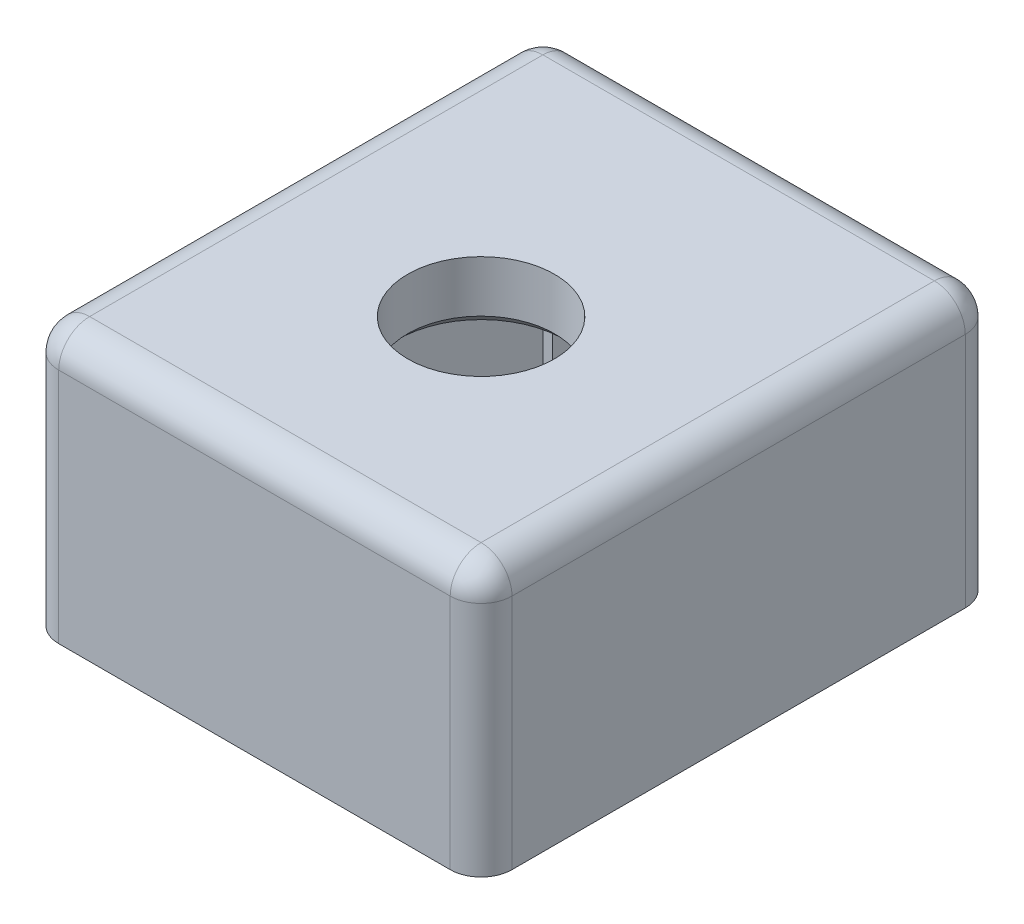
ISO-10303-21;
HEADER;
FILE_DESCRIPTION(('STEP AP214'),'2;1');
FILE_NAME('part.step','',(''),(''),'','','');
FILE_SCHEMA(('AUTOMOTIVE_DESIGN { 1 0 10303 214 1 1 1 1 }'));
ENDSEC;
DATA;
#1=APPLICATION_CONTEXT('core data for automotive mechanical design processes');
#2=APPLICATION_PROTOCOL_DEFINITION('international standard','automotive_design',2000,#1);
#3=PRODUCT_CONTEXT('',#1,'mechanical');
#4=PRODUCT('Part','Part','',(#3));
#5=PRODUCT_RELATED_PRODUCT_CATEGORY('part','',(#4));
#6=PRODUCT_DEFINITION_FORMATION('','',#4);
#7=PRODUCT_DEFINITION_CONTEXT('part definition',#1,'design');
#8=PRODUCT_DEFINITION('design','',#6,#7);
#9=PRODUCT_DEFINITION_SHAPE('','',#8);
#10=(LENGTH_UNIT() NAMED_UNIT(*) SI_UNIT(.MILLI.,.METRE.));
#11=(NAMED_UNIT(*) PLANE_ANGLE_UNIT() SI_UNIT($,.RADIAN.));
#12=(NAMED_UNIT(*) SI_UNIT($,.STERADIAN.) SOLID_ANGLE_UNIT());
#13=UNCERTAINTY_MEASURE_WITH_UNIT(LENGTH_MEASURE(1.E-05),#10,'distance_accuracy_value','');
#14=(GEOMETRIC_REPRESENTATION_CONTEXT(3) GLOBAL_UNCERTAINTY_ASSIGNED_CONTEXT((#13)) GLOBAL_UNIT_ASSIGNED_CONTEXT((#10,
#11,#12)) REPRESENTATION_CONTEXT('',''));
#15=CARTESIAN_POINT('',(0.,0.,0.));
#16=DIRECTION('',(0.,0.,1.));
#17=DIRECTION('',(1.,0.,0.));
#18=AXIS2_PLACEMENT_3D('',#15,#16,#17);
#19=CARTESIAN_POINT('',(0.,3.,0.));
#20=DIRECTION('',(0.,1.,0.));
#21=DIRECTION('',(0.,0.,1.));
#22=AXIS2_PLACEMENT_3D('',#19,#20,#21);
#23=PLANE('',#22);
#24=DIRECTION('',(0.,0.,-1.));
#25=VECTOR('',#24,1.);
#26=CARTESIAN_POINT('',(9.5,3.,-14.));
#27=LINE('',#26,#25);
#28=CARTESIAN_POINT('',(9.50000000000001,3.,9.5));
#29=VERTEX_POINT('',#28);
#30=CARTESIAN_POINT('',(9.5,3.,-12.5));
#31=VERTEX_POINT('',#30);
#32=EDGE_CURVE('E450',#29,#31,#27,.T.);
#33=ORIENTED_EDGE('',*,*,#32,.T.);
#34=DIRECTION('',(-1.,0.,0.));
#35=VECTOR('',#34,1.);
#36=CARTESIAN_POINT('',(-11.,3.,-12.5));
#37=LINE('',#36,#35);
#38=CARTESIAN_POINT('',(-9.5,3.,-12.5));
#39=VERTEX_POINT('',#38);
#40=EDGE_CURVE('E453',#31,#39,#37,.T.);
#41=ORIENTED_EDGE('',*,*,#40,.T.);
#42=DIRECTION('',(0.,0.,1.));
#43=VECTOR('',#42,1.);
#44=CARTESIAN_POINT('',(-9.5,3.,11.));
#45=LINE('',#44,#43);
#46=CARTESIAN_POINT('',(-9.5,3.,9.5));
#47=VERTEX_POINT('',#46);
#48=EDGE_CURVE('E447',#39,#47,#45,.T.);
#49=ORIENTED_EDGE('',*,*,#48,.T.);
#50=DIRECTION('',(1.,0.,0.));
#51=VECTOR('',#50,1.);
#52=CARTESIAN_POINT('',(11.,3.,9.5));
#53=LINE('',#52,#51);
#54=EDGE_CURVE('E444',#47,#29,#53,.T.);
#55=ORIENTED_EDGE('',*,*,#54,.T.);
#56=EDGE_LOOP('',(#33,#41,#49,#55));
#57=FACE_BOUND('',#56,.T.);
#58=CARTESIAN_POINT('',(0.,3.,0.));
#59=DIRECTION('',(0.,1.,0.));
#60=DIRECTION('',(0.,0.,1.));
#61=AXIS2_PLACEMENT_3D('',#58,#59,#60);
#62=CIRCLE('',#61,3.5625);
#63=CARTESIAN_POINT('',(0.,3.,3.5625));
#64=VERTEX_POINT('',#63);
#65=EDGE_CURVE('E398',#64,#64,#62,.T.);
#66=ORIENTED_EDGE('',*,*,#65,.F.);
#67=EDGE_LOOP('',(#66));
#68=FACE_BOUND('',#67,.T.);
#69=ADVANCED_FACE('F41',(#57,#68),#23,.T.);
#70=CARTESIAN_POINT('',(0.,0.,0.));
#71=DIRECTION('',(0.,1.,0.));
#72=DIRECTION('',(0.,0.,1.));
#73=AXIS2_PLACEMENT_3D('',#70,#71,#72);
#74=PLANE('',#73);
#75=CARTESIAN_POINT('',(0.,0.,0.));
#76=DIRECTION('',(0.,1.,0.));
#77=DIRECTION('',(0.,0.,1.));
#78=AXIS2_PLACEMENT_3D('',#75,#76,#77);
#79=CIRCLE('',#78,4.06250000000001);
#80=CARTESIAN_POINT('',(0.,0.,4.06250000000001));
#81=VERTEX_POINT('',#80);
#82=EDGE_CURVE('E466',#81,#81,#79,.T.);
#83=ORIENTED_EDGE('',*,*,#82,.T.);
#84=EDGE_LOOP('',(#83));
#85=FACE_BOUND('',#84,.T.);
#86=DIRECTION('',(1.,0.,0.));
#87=VECTOR('',#86,1.);
#88=CARTESIAN_POINT('',(9.,0.,-12.));
#89=LINE('',#88,#87);
#90=CARTESIAN_POINT('',(-9.,0.,-12.));
#91=VERTEX_POINT('',#90);
#92=CARTESIAN_POINT('',(9.,0.,-12.));
#93=VERTEX_POINT('',#92);
#94=EDGE_CURVE('E307',#91,#93,#89,.T.);
#95=ORIENTED_EDGE('',*,*,#94,.T.);
#96=DIRECTION('',(0.,0.,1.));
#97=VECTOR('',#96,1.);
#98=CARTESIAN_POINT('',(9.,0.,-12.));
#99=LINE('',#98,#97);
#100=CARTESIAN_POINT('',(9.,0.,9.00000000000001));
#101=VERTEX_POINT('',#100);
#102=EDGE_CURVE('E320',#93,#101,#99,.T.);
#103=ORIENTED_EDGE('',*,*,#102,.T.);
#104=DIRECTION('',(-1.,0.,0.));
#105=VECTOR('',#104,1.);
#106=CARTESIAN_POINT('',(9.,0.,9.00000000000001));
#107=LINE('',#106,#105);
#108=CARTESIAN_POINT('',(-9.,0.,9.));
#109=VERTEX_POINT('',#108);
#110=EDGE_CURVE('E324',#101,#109,#107,.T.);
#111=ORIENTED_EDGE('',*,*,#110,.T.);
#112=DIRECTION('',(0.,0.,-1.));
#113=VECTOR('',#112,1.);
#114=CARTESIAN_POINT('',(-9.,0.,-12.));
#115=LINE('',#114,#113);
#116=EDGE_CURVE('E329',#109,#91,#115,.T.);
#117=ORIENTED_EDGE('',*,*,#116,.T.);
#118=EDGE_LOOP('',(#95,#103,#111,#117));
#119=FACE_BOUND('',#118,.T.);
#120=DIRECTION('',(1.,0.,0.));
#121=VECTOR('',#120,1.);
#122=CARTESIAN_POINT('',(8.5,0.,1.375));
#123=LINE('',#122,#121);
#124=CARTESIAN_POINT('',(7.,0.,1.375));
#125=VERTEX_POINT('',#124);
#126=CARTESIAN_POINT('',(8.,0.,1.375));
#127=VERTEX_POINT('',#126);
#128=EDGE_CURVE('E538',#125,#127,#123,.T.);
#129=ORIENTED_EDGE('',*,*,#128,.T.);
#130=CARTESIAN_POINT('',(8.,0.,0.875));
#131=DIRECTION('',(0.,1.,0.));
#132=DIRECTION('',(0.,0.,1.));
#133=AXIS2_PLACEMENT_3D('',#130,#131,#132);
#134=CIRCLE('',#133,0.5);
#135=CARTESIAN_POINT('',(8.5,0.,0.875));
#136=VERTEX_POINT('',#135);
#137=EDGE_CURVE('E541',#127,#136,#134,.T.);
#138=ORIENTED_EDGE('',*,*,#137,.T.);
#139=DIRECTION('',(0.,0.,-1.));
#140=VECTOR('',#139,1.);
#141=CARTESIAN_POINT('',(8.5,0.,-1.375));
#142=LINE('',#141,#140);
#143=CARTESIAN_POINT('',(8.5,0.,-0.875));
#144=VERTEX_POINT('',#143);
#145=EDGE_CURVE('E390',#136,#144,#142,.T.);
#146=ORIENTED_EDGE('',*,*,#145,.T.);
#147=CARTESIAN_POINT('',(8.,0.,-0.875));
#148=DIRECTION('',(0.,1.,0.));
#149=DIRECTION('',(0.,0.,1.));
#150=AXIS2_PLACEMENT_3D('',#147,#148,#149);
#151=CIRCLE('',#150,0.5);
#152=CARTESIAN_POINT('',(8.,0.,-1.375));
#153=VERTEX_POINT('',#152);
#154=EDGE_CURVE('E559',#144,#153,#151,.T.);
#155=ORIENTED_EDGE('',*,*,#154,.T.);
#156=DIRECTION('',(-1.,0.,0.));
#157=VECTOR('',#156,1.);
#158=CARTESIAN_POINT('',(8.5,0.,-1.375));
#159=LINE('',#158,#157);
#160=CARTESIAN_POINT('',(7.,0.,-1.375));
#161=VERTEX_POINT('',#160);
#162=EDGE_CURVE('E369',#153,#161,#159,.T.);
#163=ORIENTED_EDGE('',*,*,#162,.T.);
#164=CARTESIAN_POINT('',(7.,0.,-0.875));
#165=DIRECTION('',(0.,1.,0.));
#166=DIRECTION('',(0.,0.,1.));
#167=AXIS2_PLACEMENT_3D('',#164,#165,#166);
#168=CIRCLE('',#167,0.5);
#169=CARTESIAN_POINT('',(6.5,0.,-0.875));
#170=VERTEX_POINT('',#169);
#171=EDGE_CURVE('E563',#161,#170,#168,.T.);
#172=ORIENTED_EDGE('',*,*,#171,.T.);
#173=DIRECTION('',(0.,0.,1.));
#174=VECTOR('',#173,1.);
#175=CARTESIAN_POINT('',(6.5,0.,-1.375));
#176=LINE('',#175,#174);
#177=CARTESIAN_POINT('',(6.5,0.,0.875));
#178=VERTEX_POINT('',#177);
#179=EDGE_CURVE('E403',#170,#178,#176,.T.);
#180=ORIENTED_EDGE('',*,*,#179,.T.);
#181=CARTESIAN_POINT('',(7.,0.,0.875));
#182=DIRECTION('',(0.,1.,0.));
#183=DIRECTION('',(0.,0.,1.));
#184=AXIS2_PLACEMENT_3D('',#181,#182,#183);
#185=CIRCLE('',#184,0.5);
#186=EDGE_CURVE('E544',#178,#125,#185,.T.);
#187=ORIENTED_EDGE('',*,*,#186,.T.);
#188=EDGE_LOOP('',(#129,#138,#146,#155,#163,#172,#180,#187));
#189=FACE_BOUND('',#188,.T.);
#190=ADVANCED_FACE('F529',(#85,#119,#189),#74,.F.);
#191=CARTESIAN_POINT('',(-11.,3.,11.));
#192=DIRECTION('',(1.,0.,0.));
#193=DIRECTION('',(0.,0.,-1.));
#194=AXIS2_PLACEMENT_3D('',#191,#192,#193);
#195=PLANE('',#194);
#196=DIRECTION('',(0.,0.,1.));
#197=VECTOR('',#196,1.);
#198=CARTESIAN_POINT('',(-11.,1.5,-14.));
#199=LINE('',#198,#197);
#200=CARTESIAN_POINT('',(-11.,1.5,9.5));
#201=VERTEX_POINT('',#200);
#202=CARTESIAN_POINT('',(-11.,1.5,-12.5));
#203=VERTEX_POINT('',#202);
#204=EDGE_CURVE('E406',#201,#203,#199,.F.);
#205=ORIENTED_EDGE('',*,*,#204,.T.);
#206=DIRECTION('',(0.,-1.,0.));
#207=VECTOR('',#206,1.);
#208=CARTESIAN_POINT('',(-11.,3.,-12.5));
#209=LINE('',#208,#207);
#210=CARTESIAN_POINT('',(-11.,-10.,-12.5));
#211=VERTEX_POINT('',#210);
#212=EDGE_CURVE('E409',#203,#211,#209,.T.);
#213=ORIENTED_EDGE('',*,*,#212,.T.);
#214=DIRECTION('',(0.,0.,-1.));
#215=VECTOR('',#214,1.);
#216=CARTESIAN_POINT('',(-11.,-10.,-14.));
#217=LINE('',#216,#215);
#218=CARTESIAN_POINT('',(-11.,-10.,9.5));
#219=VERTEX_POINT('',#218);
#220=EDGE_CURVE('E348',#219,#211,#217,.T.);
#221=ORIENTED_EDGE('',*,*,#220,.F.);
#222=DIRECTION('',(0.,-1.,0.));
#223=VECTOR('',#222,1.);
#224=CARTESIAN_POINT('',(-11.,3.,9.5));
#225=LINE('',#224,#223);
#226=EDGE_CURVE('E402',#219,#201,#225,.F.);
#227=ORIENTED_EDGE('',*,*,#226,.T.);
#228=EDGE_LOOP('',(#205,#213,#221,#227));
#229=FACE_BOUND('',#228,.T.);
#230=ADVANCED_FACE('F532',(#229),#195,.F.);
#231=CARTESIAN_POINT('',(11.,3.,11.));
#232=DIRECTION('',(0.,0.,-1.));
#233=DIRECTION('',(-1.,0.,0.));
#234=AXIS2_PLACEMENT_3D('',#231,#232,#233);
#235=PLANE('',#234);
#236=DIRECTION('',(-1.,0.,0.));
#237=VECTOR('',#236,1.);
#238=CARTESIAN_POINT('',(11.,-10.,11.));
#239=LINE('',#238,#237);
#240=CARTESIAN_POINT('',(9.50000000000001,-10.,11.));
#241=VERTEX_POINT('',#240);
#242=CARTESIAN_POINT('',(-9.5,-10.,11.));
#243=VERTEX_POINT('',#242);
#244=EDGE_CURVE('E359',#241,#243,#239,.T.);
#245=ORIENTED_EDGE('',*,*,#244,.F.);
#246=DIRECTION('',(0.,-1.,0.));
#247=VECTOR('',#246,1.);
#248=CARTESIAN_POINT('',(9.50000000000001,3.,11.));
#249=LINE('',#248,#247);
#250=CARTESIAN_POINT('',(9.50000000000001,1.5,11.));
#251=VERTEX_POINT('',#250);
#252=EDGE_CURVE('E463',#241,#251,#249,.F.);
#253=ORIENTED_EDGE('',*,*,#252,.T.);
#254=DIRECTION('',(1.,0.,0.));
#255=VECTOR('',#254,1.);
#256=CARTESIAN_POINT('',(-11.,1.5,11.));
#257=LINE('',#256,#255);
#258=CARTESIAN_POINT('',(-9.5,1.5,11.));
#259=VERTEX_POINT('',#258);
#260=EDGE_CURVE('E457',#251,#259,#257,.F.);
#261=ORIENTED_EDGE('',*,*,#260,.T.);
#262=DIRECTION('',(0.,-1.,0.));
#263=VECTOR('',#262,1.);
#264=CARTESIAN_POINT('',(-9.5,3.,11.));
#265=LINE('',#264,#263);
#266=EDGE_CURVE('E460',#259,#243,#265,.T.);
#267=ORIENTED_EDGE('',*,*,#266,.T.);
#268=EDGE_LOOP('',(#245,#253,#261,#267));
#269=FACE_BOUND('',#268,.T.);
#270=ADVANCED_FACE('F672',(#269),#235,.F.);
#271=CARTESIAN_POINT('',(11.,3.,11.));
#272=DIRECTION('',(-1.,0.,0.));
#273=DIRECTION('',(0.,0.,1.));
#274=AXIS2_PLACEMENT_3D('',#271,#272,#273);
#275=PLANE('',#274);
#276=DIRECTION('',(0.,0.,1.));
#277=VECTOR('',#276,1.);
#278=CARTESIAN_POINT('',(11.,-10.,-14.));
#279=LINE('',#278,#277);
#280=CARTESIAN_POINT('',(11.,-10.,-12.5));
#281=VERTEX_POINT('',#280);
#282=CARTESIAN_POINT('',(11.,-10.,9.5));
#283=VERTEX_POINT('',#282);
#284=EDGE_CURVE('E355',#281,#283,#279,.T.);
#285=ORIENTED_EDGE('',*,*,#284,.F.);
#286=DIRECTION('',(0.,-1.,0.));
#287=VECTOR('',#286,1.);
#288=CARTESIAN_POINT('',(11.,3.,-12.5));
#289=LINE('',#288,#287);
#290=CARTESIAN_POINT('',(11.,1.5,-12.5));
#291=VERTEX_POINT('',#290);
#292=EDGE_CURVE('E441',#281,#291,#289,.F.);
#293=ORIENTED_EDGE('',*,*,#292,.T.);
#294=DIRECTION('',(0.,0.,-1.));
#295=VECTOR('',#294,1.);
#296=CARTESIAN_POINT('',(11.,1.5,11.));
#297=LINE('',#296,#295);
#298=CARTESIAN_POINT('',(11.,1.5,9.5));
#299=VERTEX_POINT('',#298);
#300=EDGE_CURVE('E438',#291,#299,#297,.F.);
#301=ORIENTED_EDGE('',*,*,#300,.T.);
#302=DIRECTION('',(0.,-1.,0.));
#303=VECTOR('',#302,1.);
#304=CARTESIAN_POINT('',(11.,3.,9.5));
#305=LINE('',#304,#303);
#306=EDGE_CURVE('E435',#299,#283,#305,.T.);
#307=ORIENTED_EDGE('',*,*,#306,.T.);
#308=EDGE_LOOP('',(#285,#293,#301,#307));
#309=FACE_BOUND('',#308,.T.);
#310=ADVANCED_FACE('F669',(#309),#275,.F.);
#311=CARTESIAN_POINT('',(11.,3.,-14.));
#312=DIRECTION('',(0.,0.,1.));
#313=DIRECTION('',(1.,0.,0.));
#314=AXIS2_PLACEMENT_3D('',#311,#312,#313);
#315=PLANE('',#314);
#316=DIRECTION('',(1.,0.,0.));
#317=VECTOR('',#316,1.);
#318=CARTESIAN_POINT('',(11.,-10.,-14.));
#319=LINE('',#318,#317);
#320=CARTESIAN_POINT('',(8.52838388934091,-10.,-14.));
#321=VERTEX_POINT('',#320);
#322=CARTESIAN_POINT('',(9.5,-10.,-14.));
#323=VERTEX_POINT('',#322);
#324=EDGE_CURVE('E351',#321,#323,#319,.T.);
#325=ORIENTED_EDGE('',*,*,#324,.F.);
#326=DIRECTION('',(0.,-1.,0.));
#327=VECTOR('',#326,1.);
#328=CARTESIAN_POINT('',(8.52838388934091,-18.5283838893409,-14.));
#329=LINE('',#328,#327);
#330=CARTESIAN_POINT('',(8.52838388934091,-1.47161611065909,-14.));
#331=VERTEX_POINT('',#330);
#332=EDGE_CURVE('E286',#331,#321,#329,.T.);
#333=ORIENTED_EDGE('',*,*,#332,.F.);
#334=DIRECTION('',(1.,0.,0.));
#335=VECTOR('',#334,1.);
#336=CARTESIAN_POINT('',(-8.52838388934091,-1.47161611065909,-14.));
#337=LINE('',#336,#335);
#338=CARTESIAN_POINT('',(-8.52838388934091,-1.47161611065909,-14.));
#339=VERTEX_POINT('',#338);
#340=EDGE_CURVE('E270',#339,#331,#337,.T.);
#341=ORIENTED_EDGE('',*,*,#340,.F.);
#342=DIRECTION('',(0.,1.,0.));
#343=VECTOR('',#342,1.);
#344=CARTESIAN_POINT('',(-8.52838388934091,-18.5283838893409,-14.));
#345=LINE('',#344,#343);
#346=CARTESIAN_POINT('',(-8.52838388934091,-10.,-14.));
#347=VERTEX_POINT('',#346);
#348=EDGE_CURVE('E278',#347,#339,#345,.T.);
#349=ORIENTED_EDGE('',*,*,#348,.F.);
#350=CARTESIAN_POINT('',(-9.5,-10.,-14.));
#351=VERTEX_POINT('',#350);
#352=EDGE_CURVE('E352',#351,#347,#319,.T.);
#353=ORIENTED_EDGE('',*,*,#352,.F.);
#354=DIRECTION('',(0.,-1.,0.));
#355=VECTOR('',#354,1.);
#356=CARTESIAN_POINT('',(-9.5,3.,-14.));
#357=LINE('',#356,#355);
#358=CARTESIAN_POINT('',(-9.5,1.5,-14.));
#359=VERTEX_POINT('',#358);
#360=EDGE_CURVE('E432',#351,#359,#357,.F.);
#361=ORIENTED_EDGE('',*,*,#360,.T.);
#362=DIRECTION('',(-1.,0.,0.));
#363=VECTOR('',#362,1.);
#364=CARTESIAN_POINT('',(11.,1.5,-14.));
#365=LINE('',#364,#363);
#366=CARTESIAN_POINT('',(9.5,1.5,-14.));
#367=VERTEX_POINT('',#366);
#368=EDGE_CURVE('E425',#359,#367,#365,.F.);
#369=ORIENTED_EDGE('',*,*,#368,.T.);
#370=DIRECTION('',(0.,-1.,0.));
#371=VECTOR('',#370,1.);
#372=CARTESIAN_POINT('',(9.5,3.,-14.));
#373=LINE('',#372,#371);
#374=EDGE_CURVE('E428',#367,#323,#373,.T.);
#375=ORIENTED_EDGE('',*,*,#374,.T.);
#376=EDGE_LOOP('',(#325,#333,#341,#349,#353,#361,#369,#375));
#377=FACE_BOUND('',#376,.T.);
#378=ADVANCED_FACE('F289',(#377),#315,.F.);
#379=CARTESIAN_POINT('',(0.,3.,0.));
#380=DIRECTION('',(0.,-1.,0.));
#381=DIRECTION('',(0.,0.,-1.));
#382=AXIS2_PLACEMENT_3D('',#379,#380,#381);
#383=CYLINDRICAL_SURFACE('',#382,3.5625);
#384=CARTESIAN_POINT('',(0.,0.500000000000008,0.));
#385=DIRECTION('',(0.,1.,0.));
#386=DIRECTION('',(0.,0.,1.));
#387=AXIS2_PLACEMENT_3D('',#384,#385,#386);
#388=CIRCLE('',#387,3.5625);
#389=CARTESIAN_POINT('',(0.,0.500000000000008,3.5625));
#390=VERTEX_POINT('',#389);
#391=EDGE_CURVE('E381',#390,#390,#388,.F.);
#392=ORIENTED_EDGE('',*,*,#391,.T.);
#393=EDGE_LOOP('',(#392));
#394=FACE_BOUND('',#393,.T.);
#395=ORIENTED_EDGE('',*,*,#65,.T.);
#396=EDGE_LOOP('',(#395));
#397=FACE_BOUND('',#396,.T.);
#398=ADVANCED_FACE('F518',(#394,#397),#383,.F.);
#399=CARTESIAN_POINT('',(0.,2.,0.));
#400=DIRECTION('',(0.,1.,0.));
#401=DIRECTION('',(0.,0.,1.));
#402=AXIS2_PLACEMENT_3D('',#399,#400,#401);
#403=PLANE('',#402);
#404=DIRECTION('',(-1.,0.,0.));
#405=VECTOR('',#404,1.);
#406=CARTESIAN_POINT('',(8.5,2.,-1.375));
#407=LINE('',#406,#405);
#408=CARTESIAN_POINT('',(8.,2.,-1.375));
#409=VERTEX_POINT('',#408);
#410=CARTESIAN_POINT('',(7.,2.,-1.375));
#411=VERTEX_POINT('',#410);
#412=EDGE_CURVE('E363',#409,#411,#407,.T.);
#413=ORIENTED_EDGE('',*,*,#412,.F.);
#414=CARTESIAN_POINT('',(8.,2.,-0.875));
#415=DIRECTION('',(0.,1.,0.));
#416=DIRECTION('',(0.,0.,1.));
#417=AXIS2_PLACEMENT_3D('',#414,#415,#416);
#418=CIRCLE('',#417,0.5);
#419=CARTESIAN_POINT('',(8.5,2.,-0.875));
#420=VERTEX_POINT('',#419);
#421=EDGE_CURVE('E623',#409,#420,#418,.F.);
#422=ORIENTED_EDGE('',*,*,#421,.T.);
#423=DIRECTION('',(0.,0.,-1.));
#424=VECTOR('',#423,1.);
#425=CARTESIAN_POINT('',(8.5,2.,-1.375));
#426=LINE('',#425,#424);
#427=CARTESIAN_POINT('',(8.5,2.,0.875));
#428=VERTEX_POINT('',#427);
#429=EDGE_CURVE('E374',#428,#420,#426,.T.);
#430=ORIENTED_EDGE('',*,*,#429,.F.);
#431=CARTESIAN_POINT('',(8.,2.,0.875));
#432=DIRECTION('',(0.,1.,0.));
#433=DIRECTION('',(0.,0.,1.));
#434=AXIS2_PLACEMENT_3D('',#431,#432,#433);
#435=CIRCLE('',#434,0.5);
#436=CARTESIAN_POINT('',(8.,2.,1.375));
#437=VERTEX_POINT('',#436);
#438=EDGE_CURVE('E621',#428,#437,#435,.F.);
#439=ORIENTED_EDGE('',*,*,#438,.T.);
#440=DIRECTION('',(1.,0.,0.));
#441=VECTOR('',#440,1.);
#442=CARTESIAN_POINT('',(8.5,2.,1.375));
#443=LINE('',#442,#441);
#444=CARTESIAN_POINT('',(7.,2.,1.375));
#445=VERTEX_POINT('',#444);
#446=EDGE_CURVE('E391',#445,#437,#443,.T.);
#447=ORIENTED_EDGE('',*,*,#446,.F.);
#448=CARTESIAN_POINT('',(7.,2.,0.875));
#449=DIRECTION('',(0.,1.,0.));
#450=DIRECTION('',(0.,0.,1.));
#451=AXIS2_PLACEMENT_3D('',#448,#449,#450);
#452=CIRCLE('',#451,0.5);
#453=CARTESIAN_POINT('',(6.5,2.,0.875));
#454=VERTEX_POINT('',#453);
#455=EDGE_CURVE('E607',#445,#454,#452,.F.);
#456=ORIENTED_EDGE('',*,*,#455,.T.);
#457=DIRECTION('',(0.,0.,1.));
#458=VECTOR('',#457,1.);
#459=CARTESIAN_POINT('',(6.5,2.,-1.375));
#460=LINE('',#459,#458);
#461=CARTESIAN_POINT('',(6.5,2.,-0.875));
#462=VERTEX_POINT('',#461);
#463=EDGE_CURVE('E549',#462,#454,#460,.T.);
#464=ORIENTED_EDGE('',*,*,#463,.F.);
#465=CARTESIAN_POINT('',(7.,2.,-0.875));
#466=DIRECTION('',(0.,1.,0.));
#467=DIRECTION('',(0.,0.,1.));
#468=AXIS2_PLACEMENT_3D('',#465,#466,#467);
#469=CIRCLE('',#468,0.5);
#470=EDGE_CURVE('E385',#462,#411,#469,.F.);
#471=ORIENTED_EDGE('',*,*,#470,.T.);
#472=EDGE_LOOP('',(#413,#422,#430,#439,#447,#456,#464,#471));
#473=FACE_BOUND('',#472,.T.);
#474=ADVANCED_FACE('F642',(#473),#403,.F.);
#475=CARTESIAN_POINT('',(8.5,0.,-1.375));
#476=DIRECTION('',(0.,0.,-1.));
#477=DIRECTION('',(-1.,0.,0.));
#478=AXIS2_PLACEMENT_3D('',#475,#476,#477);
#479=PLANE('',#478);
#480=ORIENTED_EDGE('',*,*,#162,.F.);
#481=DIRECTION('',(0.,1.,0.));
#482=VECTOR('',#481,1.);
#483=CARTESIAN_POINT('',(8.,2.,-1.375));
#484=LINE('',#483,#482);
#485=EDGE_CURVE('E380',#153,#409,#484,.T.);
#486=ORIENTED_EDGE('',*,*,#485,.T.);
#487=ORIENTED_EDGE('',*,*,#412,.T.);
#488=DIRECTION('',(0.,1.,0.));
#489=VECTOR('',#488,1.);
#490=CARTESIAN_POINT('',(7.,0.,-1.375));
#491=LINE('',#490,#489);
#492=EDGE_CURVE('E377',#411,#161,#491,.F.);
#493=ORIENTED_EDGE('',*,*,#492,.T.);
#494=EDGE_LOOP('',(#480,#486,#487,#493));
#495=FACE_BOUND('',#494,.T.);
#496=ADVANCED_FACE('F656',(#495),#479,.F.);
#497=CARTESIAN_POINT('',(8.5,0.,-1.375));
#498=DIRECTION('',(1.,0.,0.));
#499=DIRECTION('',(0.,0.,-1.));
#500=AXIS2_PLACEMENT_3D('',#497,#498,#499);
#501=PLANE('',#500);
#502=ORIENTED_EDGE('',*,*,#429,.T.);
#503=DIRECTION('',(0.,1.,0.));
#504=VECTOR('',#503,1.);
#505=CARTESIAN_POINT('',(8.5,0.,-0.875));
#506=LINE('',#505,#504);
#507=EDGE_CURVE('E617',#420,#144,#506,.F.);
#508=ORIENTED_EDGE('',*,*,#507,.T.);
#509=ORIENTED_EDGE('',*,*,#145,.F.);
#510=DIRECTION('',(0.,1.,0.));
#511=VECTOR('',#510,1.);
#512=CARTESIAN_POINT('',(8.5,2.,0.875));
#513=LINE('',#512,#511);
#514=EDGE_CURVE('E557',#136,#428,#513,.T.);
#515=ORIENTED_EDGE('',*,*,#514,.T.);
#516=EDGE_LOOP('',(#502,#508,#509,#515));
#517=FACE_BOUND('',#516,.T.);
#518=ADVANCED_FACE('F649',(#517),#501,.F.);
#519=CARTESIAN_POINT('',(8.5,0.,1.375));
#520=DIRECTION('',(0.,0.,1.));
#521=DIRECTION('',(1.,0.,0.));
#522=AXIS2_PLACEMENT_3D('',#519,#520,#521);
#523=PLANE('',#522);
#524=ORIENTED_EDGE('',*,*,#446,.T.);
#525=DIRECTION('',(0.,1.,0.));
#526=VECTOR('',#525,1.);
#527=CARTESIAN_POINT('',(8.,0.,1.375));
#528=LINE('',#527,#526);
#529=EDGE_CURVE('E555',#437,#127,#528,.F.);
#530=ORIENTED_EDGE('',*,*,#529,.T.);
#531=ORIENTED_EDGE('',*,*,#128,.F.);
#532=DIRECTION('',(0.,1.,0.));
#533=VECTOR('',#532,1.);
#534=CARTESIAN_POINT('',(7.,2.,1.375));
#535=LINE('',#534,#533);
#536=EDGE_CURVE('E615',#125,#445,#535,.T.);
#537=ORIENTED_EDGE('',*,*,#536,.T.);
#538=EDGE_LOOP('',(#524,#530,#531,#537));
#539=FACE_BOUND('',#538,.T.);
#540=ADVANCED_FACE('F647',(#539),#523,.F.);
#541=CARTESIAN_POINT('',(6.5,0.,-1.375));
#542=DIRECTION('',(-1.,0.,0.));
#543=DIRECTION('',(0.,0.,1.));
#544=AXIS2_PLACEMENT_3D('',#541,#542,#543);
#545=PLANE('',#544);
#546=ORIENTED_EDGE('',*,*,#463,.T.);
#547=DIRECTION('',(0.,1.,0.));
#548=VECTOR('',#547,1.);
#549=CARTESIAN_POINT('',(6.5,0.,0.875));
#550=LINE('',#549,#548);
#551=EDGE_CURVE('E71',#454,#178,#550,.F.);
#552=ORIENTED_EDGE('',*,*,#551,.T.);
#553=ORIENTED_EDGE('',*,*,#179,.F.);
#554=DIRECTION('',(0.,1.,0.));
#555=VECTOR('',#554,1.);
#556=CARTESIAN_POINT('',(6.5,2.,-0.875));
#557=LINE('',#556,#555);
#558=EDGE_CURVE('E602',#170,#462,#557,.T.);
#559=ORIENTED_EDGE('',*,*,#558,.T.);
#560=EDGE_LOOP('',(#546,#552,#553,#559));
#561=FACE_BOUND('',#560,.T.);
#562=ADVANCED_FACE('F644',(#561),#545,.F.);
#563=CARTESIAN_POINT('',(0.,-10.,0.));
#564=DIRECTION('',(0.,-1.,0.));
#565=DIRECTION('',(0.,0.,-1.));
#566=AXIS2_PLACEMENT_3D('',#563,#564,#565);
#567=PLANE('',#566);
#568=DIRECTION('',(0.,0.,1.));
#569=VECTOR('',#568,1.);
#570=CARTESIAN_POINT('',(8.52838388934091,-10.,0.));
#571=LINE('',#570,#569);
#572=CARTESIAN_POINT('',(8.52838388934091,-10.,-12.));
#573=VERTEX_POINT('',#572);
#574=EDGE_CURVE('E299',#321,#573,#571,.T.);
#575=ORIENTED_EDGE('',*,*,#574,.F.);
#576=ORIENTED_EDGE('',*,*,#324,.T.);
#577=CARTESIAN_POINT('',(9.5,-10.,-12.5));
#578=DIRECTION('',(0.,-1.,0.));
#579=DIRECTION('',(0.,0.,-1.));
#580=AXIS2_PLACEMENT_3D('',#577,#578,#579);
#581=CIRCLE('',#580,1.5);
#582=EDGE_CURVE('E419',#323,#281,#581,.T.);
#583=ORIENTED_EDGE('',*,*,#582,.T.);
#584=ORIENTED_EDGE('',*,*,#284,.T.);
#585=CARTESIAN_POINT('',(9.50000000000001,-10.,9.5));
#586=DIRECTION('',(0.,-1.,0.));
#587=DIRECTION('',(0.,0.,-1.));
#588=AXIS2_PLACEMENT_3D('',#585,#586,#587);
#589=CIRCLE('',#588,1.5);
#590=EDGE_CURVE('E416',#283,#241,#589,.T.);
#591=ORIENTED_EDGE('',*,*,#590,.T.);
#592=ORIENTED_EDGE('',*,*,#244,.T.);
#593=CARTESIAN_POINT('',(-9.5,-10.,9.5));
#594=DIRECTION('',(0.,-1.,0.));
#595=DIRECTION('',(0.,0.,-1.));
#596=AXIS2_PLACEMENT_3D('',#593,#594,#595);
#597=CIRCLE('',#596,1.5);
#598=EDGE_CURVE('E413',#243,#219,#597,.T.);
#599=ORIENTED_EDGE('',*,*,#598,.T.);
#600=ORIENTED_EDGE('',*,*,#220,.T.);
#601=CARTESIAN_POINT('',(-9.5,-10.,-12.5));
#602=DIRECTION('',(0.,-1.,0.));
#603=DIRECTION('',(0.,0.,-1.));
#604=AXIS2_PLACEMENT_3D('',#601,#602,#603);
#605=CIRCLE('',#604,1.5);
#606=EDGE_CURVE('E422',#211,#351,#605,.T.);
#607=ORIENTED_EDGE('',*,*,#606,.T.);
#608=ORIENTED_EDGE('',*,*,#352,.T.);
#609=DIRECTION('',(0.,0.,-1.));
#610=VECTOR('',#609,1.);
#611=CARTESIAN_POINT('',(-8.52838388934091,-10.,0.));
#612=LINE('',#611,#610);
#613=CARTESIAN_POINT('',(-8.52838388934091,-10.,-12.));
#614=VERTEX_POINT('',#613);
#615=EDGE_CURVE('E281',#614,#347,#612,.T.);
#616=ORIENTED_EDGE('',*,*,#615,.F.);
#617=DIRECTION('',(1.,0.,0.));
#618=VECTOR('',#617,1.);
#619=CARTESIAN_POINT('',(9.,-10.,-12.));
#620=LINE('',#619,#618);
#621=CARTESIAN_POINT('',(-9.,-10.,-12.));
#622=VERTEX_POINT('',#621);
#623=EDGE_CURVE('E315',#622,#614,#620,.T.);
#624=ORIENTED_EDGE('',*,*,#623,.F.);
#625=DIRECTION('',(0.,0.,-1.));
#626=VECTOR('',#625,1.);
#627=CARTESIAN_POINT('',(-9.,-10.,-12.));
#628=LINE('',#627,#626);
#629=CARTESIAN_POINT('',(-9.,-10.,9.));
#630=VERTEX_POINT('',#629);
#631=EDGE_CURVE('E310',#630,#622,#628,.T.);
#632=ORIENTED_EDGE('',*,*,#631,.F.);
#633=DIRECTION('',(-1.,0.,0.));
#634=VECTOR('',#633,1.);
#635=CARTESIAN_POINT('',(9.,-10.,9.00000000000001));
#636=LINE('',#635,#634);
#637=CARTESIAN_POINT('',(9.,-10.,9.00000000000001));
#638=VERTEX_POINT('',#637);
#639=EDGE_CURVE('E306',#638,#630,#636,.T.);
#640=ORIENTED_EDGE('',*,*,#639,.F.);
#641=DIRECTION('',(0.,0.,1.));
#642=VECTOR('',#641,1.);
#643=CARTESIAN_POINT('',(9.,-10.,-12.));
#644=LINE('',#643,#642);
#645=CARTESIAN_POINT('',(9.,-10.,-12.));
#646=VERTEX_POINT('',#645);
#647=EDGE_CURVE('E303',#646,#638,#644,.T.);
#648=ORIENTED_EDGE('',*,*,#647,.F.);
#649=EDGE_CURVE('E314',#573,#646,#620,.T.);
#650=ORIENTED_EDGE('',*,*,#649,.F.);
#651=EDGE_LOOP('',(#575,#576,#583,#584,#591,#592,#599,#600,#607,#608,#616,#624,#632,#640,#648,#650));
#652=FACE_BOUND('',#651,.T.);
#653=ADVANCED_FACE('F577',(#652),#567,.T.);
#654=CARTESIAN_POINT('',(9.,-10.,-12.));
#655=DIRECTION('',(-1.,0.,0.));
#656=DIRECTION('',(0.,0.,1.));
#657=AXIS2_PLACEMENT_3D('',#654,#655,#656);
#658=PLANE('',#657);
#659=ORIENTED_EDGE('',*,*,#102,.F.);
#660=DIRECTION('',(0.,1.,0.));
#661=VECTOR('',#660,1.);
#662=CARTESIAN_POINT('',(9.,-10.,-12.));
#663=LINE('',#662,#661);
#664=EDGE_CURVE('E319',#646,#93,#663,.T.);
#665=ORIENTED_EDGE('',*,*,#664,.F.);
#666=ORIENTED_EDGE('',*,*,#647,.T.);
#667=DIRECTION('',(0.,1.,0.));
#668=VECTOR('',#667,1.);
#669=CARTESIAN_POINT('',(9.,-10.,9.00000000000001));
#670=LINE('',#669,#668);
#671=EDGE_CURVE('E344',#638,#101,#670,.T.);
#672=ORIENTED_EDGE('',*,*,#671,.T.);
#673=EDGE_LOOP('',(#659,#665,#666,#672));
#674=FACE_BOUND('',#673,.T.);
#675=ADVANCED_FACE('F593',(#674),#658,.T.);
#676=CARTESIAN_POINT('',(9.,-10.,9.00000000000001));
#677=DIRECTION('',(0.,0.,-1.));
#678=DIRECTION('',(-1.,0.,0.));
#679=AXIS2_PLACEMENT_3D('',#676,#677,#678);
#680=PLANE('',#679);
#681=ORIENTED_EDGE('',*,*,#110,.F.);
#682=ORIENTED_EDGE('',*,*,#671,.F.);
#683=ORIENTED_EDGE('',*,*,#639,.T.);
#684=DIRECTION('',(0.,1.,0.));
#685=VECTOR('',#684,1.);
#686=CARTESIAN_POINT('',(-9.,-10.,9.));
#687=LINE('',#686,#685);
#688=EDGE_CURVE('E341',#630,#109,#687,.T.);
#689=ORIENTED_EDGE('',*,*,#688,.T.);
#690=EDGE_LOOP('',(#681,#682,#683,#689));
#691=FACE_BOUND('',#690,.T.);
#692=ADVANCED_FACE('F590',(#691),#680,.T.);
#693=CARTESIAN_POINT('',(-9.,-10.,-12.));
#694=DIRECTION('',(1.,0.,0.));
#695=DIRECTION('',(0.,0.,-1.));
#696=AXIS2_PLACEMENT_3D('',#693,#694,#695);
#697=PLANE('',#696);
#698=ORIENTED_EDGE('',*,*,#116,.F.);
#699=ORIENTED_EDGE('',*,*,#688,.F.);
#700=ORIENTED_EDGE('',*,*,#631,.T.);
#701=DIRECTION('',(0.,1.,0.));
#702=VECTOR('',#701,1.);
#703=CARTESIAN_POINT('',(-9.,-10.,-12.));
#704=LINE('',#703,#702);
#705=EDGE_CURVE('E338',#622,#91,#704,.T.);
#706=ORIENTED_EDGE('',*,*,#705,.T.);
#707=EDGE_LOOP('',(#698,#699,#700,#706));
#708=FACE_BOUND('',#707,.T.);
#709=ADVANCED_FACE('F584',(#708),#697,.T.);
#710=CARTESIAN_POINT('',(9.,-10.,-12.));
#711=DIRECTION('',(0.,0.,1.));
#712=DIRECTION('',(1.,0.,0.));
#713=AXIS2_PLACEMENT_3D('',#710,#711,#712);
#714=PLANE('',#713);
#715=DIRECTION('',(0.,1.,0.));
#716=VECTOR('',#715,1.);
#717=CARTESIAN_POINT('',(8.52838388934091,-10.,-12.));
#718=LINE('',#717,#716);
#719=CARTESIAN_POINT('',(8.52838388934091,-1.47161611065909,-12.));
#720=VERTEX_POINT('',#719);
#721=EDGE_CURVE('E12',#573,#720,#718,.T.);
#722=ORIENTED_EDGE('',*,*,#721,.F.);
#723=ORIENTED_EDGE('',*,*,#649,.T.);
#724=ORIENTED_EDGE('',*,*,#664,.T.);
#725=ORIENTED_EDGE('',*,*,#94,.F.);
#726=ORIENTED_EDGE('',*,*,#705,.F.);
#727=ORIENTED_EDGE('',*,*,#623,.T.);
#728=DIRECTION('',(0.,-1.,0.));
#729=VECTOR('',#728,1.);
#730=CARTESIAN_POINT('',(-8.52838388934091,-10.,-12.));
#731=LINE('',#730,#729);
#732=CARTESIAN_POINT('',(-8.52838388934091,-1.47161611065909,-12.));
#733=VERTEX_POINT('',#732);
#734=EDGE_CURVE('E570',#733,#614,#731,.T.);
#735=ORIENTED_EDGE('',*,*,#734,.F.);
#736=DIRECTION('',(-1.,0.,0.));
#737=VECTOR('',#736,1.);
#738=CARTESIAN_POINT('',(9.,-1.47161611065909,-12.));
#739=LINE('',#738,#737);
#740=EDGE_CURVE('E50',#720,#733,#739,.T.);
#741=ORIENTED_EDGE('',*,*,#740,.F.);
#742=EDGE_LOOP('',(#722,#723,#724,#725,#726,#727,#735,#741));
#743=FACE_BOUND('',#742,.T.);
#744=ADVANCED_FACE('F580',(#743),#714,.T.);
#745=CARTESIAN_POINT('',(9.50000000000001,3.,9.5));
#746=DIRECTION('',(0.,-1.,0.));
#747=DIRECTION('',(0.,0.,-1.));
#748=AXIS2_PLACEMENT_3D('',#745,#746,#747);
#749=CYLINDRICAL_SURFACE('',#748,1.5);
#750=CARTESIAN_POINT('',(9.50000000000001,1.5,9.5));
#751=DIRECTION('',(0.,1.,0.));
#752=DIRECTION('',(0.,0.,1.));
#753=AXIS2_PLACEMENT_3D('',#750,#751,#752);
#754=CIRCLE('',#753,1.5);
#755=EDGE_CURVE('E325',#251,#299,#754,.T.);
#756=ORIENTED_EDGE('',*,*,#755,.F.);
#757=ORIENTED_EDGE('',*,*,#252,.F.);
#758=ORIENTED_EDGE('',*,*,#590,.F.);
#759=ORIENTED_EDGE('',*,*,#306,.F.);
#760=EDGE_LOOP('',(#756,#757,#758,#759));
#761=FACE_BOUND('',#760,.T.);
#762=ADVANCED_FACE('F722',(#761),#749,.T.);
#763=CARTESIAN_POINT('',(9.50000000000001,1.5,9.5));
#764=DIRECTION('',(0.,0.,1.));
#765=DIRECTION('',(1.,0.,0.));
#766=AXIS2_PLACEMENT_3D('',#763,#764,#765);
#767=SPHERICAL_SURFACE('',#766,1.5);
#768=CARTESIAN_POINT('',(9.50000000000001,1.5,9.5));
#769=DIRECTION('',(1.,0.,0.));
#770=DIRECTION('',(0.,0.,-1.));
#771=AXIS2_PLACEMENT_3D('',#768,#769,#770);
#772=CIRCLE('',#771,1.5);
#773=EDGE_CURVE('E501',#251,#29,#772,.F.);
#774=ORIENTED_EDGE('',*,*,#773,.F.);
#775=ORIENTED_EDGE('',*,*,#755,.T.);
#776=CARTESIAN_POINT('',(9.50000000000001,1.5,9.5));
#777=DIRECTION('',(0.,0.,1.));
#778=DIRECTION('',(1.,0.,0.));
#779=AXIS2_PLACEMENT_3D('',#776,#777,#778);
#780=CIRCLE('',#779,1.5);
#781=EDGE_CURVE('E505',#29,#299,#780,.F.);
#782=ORIENTED_EDGE('',*,*,#781,.F.);
#783=EDGE_LOOP('',(#774,#775,#782));
#784=FACE_BOUND('',#783,.T.);
#785=ADVANCED_FACE('F718',(#784),#767,.T.);
#786=CARTESIAN_POINT('',(9.5,3.,-12.5));
#787=DIRECTION('',(0.,-1.,0.));
#788=DIRECTION('',(0.,0.,-1.));
#789=AXIS2_PLACEMENT_3D('',#786,#787,#788);
#790=CYLINDRICAL_SURFACE('',#789,1.5);
#791=ORIENTED_EDGE('',*,*,#582,.F.);
#792=ORIENTED_EDGE('',*,*,#374,.F.);
#793=CARTESIAN_POINT('',(9.5,1.5,-12.5));
#794=DIRECTION('',(0.,1.,0.));
#795=DIRECTION('',(0.,0.,1.));
#796=AXIS2_PLACEMENT_3D('',#793,#794,#795);
#797=CIRCLE('',#796,1.5);
#798=EDGE_CURVE('E497',#291,#367,#797,.T.);
#799=ORIENTED_EDGE('',*,*,#798,.F.);
#800=ORIENTED_EDGE('',*,*,#292,.F.);
#801=EDGE_LOOP('',(#791,#792,#799,#800));
#802=FACE_BOUND('',#801,.T.);
#803=ADVANCED_FACE('F714',(#802),#790,.T.);
#804=CARTESIAN_POINT('',(9.5,1.5,0.));
#805=DIRECTION('',(0.,0.,1.));
#806=DIRECTION('',(1.,0.,0.));
#807=AXIS2_PLACEMENT_3D('',#804,#805,#806);
#808=CYLINDRICAL_SURFACE('',#807,1.5);
#809=ORIENTED_EDGE('',*,*,#781,.T.);
#810=ORIENTED_EDGE('',*,*,#300,.F.);
#811=CARTESIAN_POINT('',(9.5,1.5,-12.5));
#812=DIRECTION('',(0.,0.,-1.));
#813=DIRECTION('',(-1.,0.,0.));
#814=AXIS2_PLACEMENT_3D('',#811,#812,#813);
#815=CIRCLE('',#814,1.5);
#816=EDGE_CURVE('E493',#31,#291,#815,.T.);
#817=ORIENTED_EDGE('',*,*,#816,.F.);
#818=ORIENTED_EDGE('',*,*,#32,.F.);
#819=EDGE_LOOP('',(#809,#810,#817,#818));
#820=FACE_BOUND('',#819,.T.);
#821=ADVANCED_FACE('F710',(#820),#808,.T.);
#822=CARTESIAN_POINT('',(0.,1.5,9.5));
#823=DIRECTION('',(-1.,0.,0.));
#824=DIRECTION('',(0.,0.,1.));
#825=AXIS2_PLACEMENT_3D('',#822,#823,#824);
#826=CYLINDRICAL_SURFACE('',#825,1.5);
#827=ORIENTED_EDGE('',*,*,#773,.T.);
#828=ORIENTED_EDGE('',*,*,#54,.F.);
#829=CARTESIAN_POINT('',(-9.5,1.5,9.5));
#830=DIRECTION('',(-1.,0.,0.));
#831=DIRECTION('',(0.,-1.,0.));
#832=AXIS2_PLACEMENT_3D('',#829,#830,#831);
#833=CIRCLE('',#832,1.5);
#834=EDGE_CURVE('E489',#259,#47,#833,.T.);
#835=ORIENTED_EDGE('',*,*,#834,.F.);
#836=ORIENTED_EDGE('',*,*,#260,.F.);
#837=EDGE_LOOP('',(#827,#828,#835,#836));
#838=FACE_BOUND('',#837,.T.);
#839=ADVANCED_FACE('F706',(#838),#826,.T.);
#840=CARTESIAN_POINT('',(-9.5,3.,9.5));
#841=DIRECTION('',(0.,-1.,0.));
#842=DIRECTION('',(0.,0.,-1.));
#843=AXIS2_PLACEMENT_3D('',#840,#841,#842);
#844=CYLINDRICAL_SURFACE('',#843,1.5);
#845=ORIENTED_EDGE('',*,*,#598,.F.);
#846=ORIENTED_EDGE('',*,*,#266,.F.);
#847=CARTESIAN_POINT('',(-9.5,1.5,9.5));
#848=DIRECTION('',(0.,1.,0.));
#849=DIRECTION('',(0.,0.,1.));
#850=AXIS2_PLACEMENT_3D('',#847,#848,#849);
#851=CIRCLE('',#850,1.5);
#852=EDGE_CURVE('E485',#201,#259,#851,.T.);
#853=ORIENTED_EDGE('',*,*,#852,.F.);
#854=ORIENTED_EDGE('',*,*,#226,.F.);
#855=EDGE_LOOP('',(#845,#846,#853,#854));
#856=FACE_BOUND('',#855,.T.);
#857=ADVANCED_FACE('F702',(#856),#844,.T.);
#858=CARTESIAN_POINT('',(9.5,1.5,-12.5));
#859=DIRECTION('',(0.,0.,1.));
#860=DIRECTION('',(1.,0.,0.));
#861=AXIS2_PLACEMENT_3D('',#858,#859,#860);
#862=SPHERICAL_SURFACE('',#861,1.5);
#863=ORIENTED_EDGE('',*,*,#816,.T.);
#864=ORIENTED_EDGE('',*,*,#798,.T.);
#865=CARTESIAN_POINT('',(9.5,1.5,-12.5));
#866=DIRECTION('',(1.,0.,0.));
#867=DIRECTION('',(0.,0.,-1.));
#868=AXIS2_PLACEMENT_3D('',#865,#866,#867);
#869=CIRCLE('',#868,1.5);
#870=EDGE_CURVE('E481',#31,#367,#869,.F.);
#871=ORIENTED_EDGE('',*,*,#870,.F.);
#872=EDGE_LOOP('',(#863,#864,#871));
#873=FACE_BOUND('',#872,.T.);
#874=ADVANCED_FACE('F698',(#873),#862,.T.);
#875=CARTESIAN_POINT('',(-9.5,1.5,9.5));
#876=DIRECTION('',(0.,0.,1.));
#877=DIRECTION('',(1.,0.,0.));
#878=AXIS2_PLACEMENT_3D('',#875,#876,#877);
#879=SPHERICAL_SURFACE('',#878,1.5);
#880=ORIENTED_EDGE('',*,*,#852,.T.);
#881=ORIENTED_EDGE('',*,*,#834,.T.);
#882=CARTESIAN_POINT('',(-9.5,1.5,9.5));
#883=DIRECTION('',(0.,0.,1.));
#884=DIRECTION('',(1.,0.,0.));
#885=AXIS2_PLACEMENT_3D('',#882,#883,#884);
#886=CIRCLE('',#885,1.5);
#887=EDGE_CURVE('E477',#201,#47,#886,.F.);
#888=ORIENTED_EDGE('',*,*,#887,.F.);
#889=EDGE_LOOP('',(#880,#881,#888));
#890=FACE_BOUND('',#889,.T.);
#891=ADVANCED_FACE('F694',(#890),#879,.T.);
#892=CARTESIAN_POINT('',(0.,1.5,-12.5));
#893=DIRECTION('',(1.,0.,0.));
#894=DIRECTION('',(0.,0.,-1.));
#895=AXIS2_PLACEMENT_3D('',#892,#893,#894);
#896=CYLINDRICAL_SURFACE('',#895,1.5);
#897=ORIENTED_EDGE('',*,*,#870,.T.);
#898=ORIENTED_EDGE('',*,*,#368,.F.);
#899=CARTESIAN_POINT('',(-9.5,1.5,-12.5));
#900=DIRECTION('',(-1.,0.,0.));
#901=DIRECTION('',(0.,0.,1.));
#902=AXIS2_PLACEMENT_3D('',#899,#900,#901);
#903=CIRCLE('',#902,1.5);
#904=EDGE_CURVE('E473',#39,#359,#903,.T.);
#905=ORIENTED_EDGE('',*,*,#904,.F.);
#906=ORIENTED_EDGE('',*,*,#40,.F.);
#907=EDGE_LOOP('',(#897,#898,#905,#906));
#908=FACE_BOUND('',#907,.T.);
#909=ADVANCED_FACE('F690',(#908),#896,.T.);
#910=CARTESIAN_POINT('',(-9.5,1.5,0.));
#911=DIRECTION('',(0.,0.,-1.));
#912=DIRECTION('',(-1.,0.,0.));
#913=AXIS2_PLACEMENT_3D('',#910,#911,#912);
#914=CYLINDRICAL_SURFACE('',#913,1.5);
#915=ORIENTED_EDGE('',*,*,#887,.T.);
#916=ORIENTED_EDGE('',*,*,#48,.F.);
#917=CARTESIAN_POINT('',(-9.5,1.5,-12.5));
#918=DIRECTION('',(0.,0.,-1.));
#919=DIRECTION('',(0.,1.,0.));
#920=AXIS2_PLACEMENT_3D('',#917,#918,#919);
#921=CIRCLE('',#920,1.5);
#922=EDGE_CURVE('E470',#203,#39,#921,.T.);
#923=ORIENTED_EDGE('',*,*,#922,.F.);
#924=ORIENTED_EDGE('',*,*,#204,.F.);
#925=EDGE_LOOP('',(#915,#916,#923,#924));
#926=FACE_BOUND('',#925,.T.);
#927=ADVANCED_FACE('F686',(#926),#914,.T.);
#928=CARTESIAN_POINT('',(-9.5,1.5,-12.5));
#929=DIRECTION('',(0.,0.,1.));
#930=DIRECTION('',(1.,0.,0.));
#931=AXIS2_PLACEMENT_3D('',#928,#929,#930);
#932=SPHERICAL_SURFACE('',#931,1.5);
#933=ORIENTED_EDGE('',*,*,#922,.T.);
#934=ORIENTED_EDGE('',*,*,#904,.T.);
#935=CARTESIAN_POINT('',(-9.5,1.5,-12.5));
#936=DIRECTION('',(0.,1.,0.));
#937=DIRECTION('',(0.,0.,1.));
#938=AXIS2_PLACEMENT_3D('',#935,#936,#937);
#939=CIRCLE('',#938,1.5);
#940=EDGE_CURVE('E302',#203,#359,#939,.F.);
#941=ORIENTED_EDGE('',*,*,#940,.F.);
#942=EDGE_LOOP('',(#933,#934,#941));
#943=FACE_BOUND('',#942,.T.);
#944=ADVANCED_FACE('F682',(#943),#932,.T.);
#945=CARTESIAN_POINT('',(-9.5,3.,-12.5));
#946=DIRECTION('',(0.,-1.,0.));
#947=DIRECTION('',(0.,0.,-1.));
#948=AXIS2_PLACEMENT_3D('',#945,#946,#947);
#949=CYLINDRICAL_SURFACE('',#948,1.5);
#950=ORIENTED_EDGE('',*,*,#940,.T.);
#951=ORIENTED_EDGE('',*,*,#360,.F.);
#952=ORIENTED_EDGE('',*,*,#606,.F.);
#953=ORIENTED_EDGE('',*,*,#212,.F.);
#954=EDGE_LOOP('',(#950,#951,#952,#953));
#955=FACE_BOUND('',#954,.T.);
#956=ADVANCED_FACE('F525',(#955),#949,.T.);
#957=CARTESIAN_POINT('',(0.,0.,0.));
#958=DIRECTION('',(0.,-1.,0.));
#959=DIRECTION('',(0.,0.,-1.));
#960=AXIS2_PLACEMENT_3D('',#957,#958,#959);
#961=CONICAL_SURFACE('',#960,4.06250000000001,0.785398163397447);
#962=ORIENTED_EDGE('',*,*,#391,.F.);
#963=EDGE_LOOP('',(#962));
#964=FACE_BOUND('',#963,.T.);
#965=ORIENTED_EDGE('',*,*,#82,.F.);
#966=EDGE_LOOP('',(#965));
#967=FACE_BOUND('',#966,.T.);
#968=ADVANCED_FACE('F521',(#964,#967),#961,.F.);
#969=CARTESIAN_POINT('',(8.,0.,-0.875));
#970=DIRECTION('',(0.,-1.,0.));
#971=DIRECTION('',(0.,0.,-1.));
#972=AXIS2_PLACEMENT_3D('',#969,#970,#971);
#973=CYLINDRICAL_SURFACE('',#972,0.5);
#974=ORIENTED_EDGE('',*,*,#154,.F.);
#975=ORIENTED_EDGE('',*,*,#507,.F.);
#976=ORIENTED_EDGE('',*,*,#421,.F.);
#977=ORIENTED_EDGE('',*,*,#485,.F.);
#978=EDGE_LOOP('',(#974,#975,#976,#977));
#979=FACE_BOUND('',#978,.T.);
#980=ADVANCED_FACE('F524',(#979),#973,.F.);
#981=CARTESIAN_POINT('',(8.,0.,0.875));
#982=DIRECTION('',(0.,-1.,0.));
#983=DIRECTION('',(0.,0.,-1.));
#984=AXIS2_PLACEMENT_3D('',#981,#982,#983);
#985=CYLINDRICAL_SURFACE('',#984,0.5);
#986=ORIENTED_EDGE('',*,*,#137,.F.);
#987=ORIENTED_EDGE('',*,*,#529,.F.);
#988=ORIENTED_EDGE('',*,*,#438,.F.);
#989=ORIENTED_EDGE('',*,*,#514,.F.);
#990=EDGE_LOOP('',(#986,#987,#988,#989));
#991=FACE_BOUND('',#990,.T.);
#992=ADVANCED_FACE('F554',(#991),#985,.F.);
#993=CARTESIAN_POINT('',(7.,0.,0.875));
#994=DIRECTION('',(0.,-1.,0.));
#995=DIRECTION('',(0.,0.,-1.));
#996=AXIS2_PLACEMENT_3D('',#993,#994,#995);
#997=CYLINDRICAL_SURFACE('',#996,0.5);
#998=ORIENTED_EDGE('',*,*,#186,.F.);
#999=ORIENTED_EDGE('',*,*,#551,.F.);
#1000=ORIENTED_EDGE('',*,*,#455,.F.);
#1001=ORIENTED_EDGE('',*,*,#536,.F.);
#1002=EDGE_LOOP('',(#998,#999,#1000,#1001));
#1003=FACE_BOUND('',#1002,.T.);
#1004=ADVANCED_FACE('F646',(#1003),#997,.F.);
#1005=CARTESIAN_POINT('',(7.,0.,-0.875));
#1006=DIRECTION('',(0.,-1.,0.));
#1007=DIRECTION('',(0.,0.,-1.));
#1008=AXIS2_PLACEMENT_3D('',#1005,#1006,#1007);
#1009=CYLINDRICAL_SURFACE('',#1008,0.5);
#1010=ORIENTED_EDGE('',*,*,#171,.F.);
#1011=ORIENTED_EDGE('',*,*,#492,.F.);
#1012=ORIENTED_EDGE('',*,*,#470,.F.);
#1013=ORIENTED_EDGE('',*,*,#558,.F.);
#1014=EDGE_LOOP('',(#1010,#1011,#1012,#1013));
#1015=FACE_BOUND('',#1014,.T.);
#1016=ADVANCED_FACE('F43',(#1015),#1009,.F.);
#1017=CARTESIAN_POINT('',(8.52838388934091,-18.5283838893409,-11.));
#1018=DIRECTION('',(1.,0.,0.));
#1019=DIRECTION('',(0.,0.,-1.));
#1020=AXIS2_PLACEMENT_3D('',#1017,#1018,#1019);
#1021=PLANE('',#1020);
#1022=ORIENTED_EDGE('',*,*,#574,.T.);
#1023=ORIENTED_EDGE('',*,*,#721,.T.);
#1024=DIRECTION('',(0.,0.,-1.));
#1025=VECTOR('',#1024,1.);
#1026=CARTESIAN_POINT('',(8.52838388934091,-1.47161611065909,-11.));
#1027=LINE('',#1026,#1025);
#1028=EDGE_CURVE('E275',#720,#331,#1027,.T.);
#1029=ORIENTED_EDGE('',*,*,#1028,.T.);
#1030=ORIENTED_EDGE('',*,*,#332,.T.);
#1031=EDGE_LOOP('',(#1022,#1023,#1029,#1030));
#1032=FACE_BOUND('',#1031,.T.);
#1033=ADVANCED_FACE('F735',(#1032),#1021,.F.);
#1034=CARTESIAN_POINT('',(-8.52838388934091,-1.47161611065909,-11.));
#1035=DIRECTION('',(0.,1.,0.));
#1036=DIRECTION('',(0.,0.,1.));
#1037=AXIS2_PLACEMENT_3D('',#1034,#1035,#1036);
#1038=PLANE('',#1037);
#1039=ORIENTED_EDGE('',*,*,#740,.T.);
#1040=DIRECTION('',(0.,0.,-1.));
#1041=VECTOR('',#1040,1.);
#1042=CARTESIAN_POINT('',(-8.52838388934091,-1.47161611065909,-11.));
#1043=LINE('',#1042,#1041);
#1044=EDGE_CURVE('E60',#733,#339,#1043,.T.);
#1045=ORIENTED_EDGE('',*,*,#1044,.T.);
#1046=ORIENTED_EDGE('',*,*,#340,.T.);
#1047=ORIENTED_EDGE('',*,*,#1028,.F.);
#1048=EDGE_LOOP('',(#1039,#1045,#1046,#1047));
#1049=FACE_BOUND('',#1048,.T.);
#1050=ADVANCED_FACE('F267',(#1049),#1038,.F.);
#1051=CARTESIAN_POINT('',(-8.52838388934091,-18.5283838893409,-11.));
#1052=DIRECTION('',(-1.,0.,0.));
#1053=DIRECTION('',(0.,0.,1.));
#1054=AXIS2_PLACEMENT_3D('',#1051,#1052,#1053);
#1055=PLANE('',#1054);
#1056=ORIENTED_EDGE('',*,*,#615,.T.);
#1057=ORIENTED_EDGE('',*,*,#348,.T.);
#1058=ORIENTED_EDGE('',*,*,#1044,.F.);
#1059=ORIENTED_EDGE('',*,*,#734,.T.);
#1060=EDGE_LOOP('',(#1056,#1057,#1058,#1059));
#1061=FACE_BOUND('',#1060,.T.);
#1062=ADVANCED_FACE('F279',(#1061),#1055,.F.);
#1063=CLOSED_SHELL('',(#69,#190,#230,#270,#310,#378,#398,#474,#496,#518,#540,#562,#653,#675,
#692,#709,#744,#762,#785,#803,#821,#839,#857,#874,#891,#909,#927,#944,#956,#968,#980,#992,#1004,
#1016,#1033,#1050,#1062));
#1064=MANIFOLD_SOLID_BREP('B2',#1063);
#1065=ADVANCED_BREP_SHAPE_REPRESENTATION('',(#18,#1064),#14);
#1066=SHAPE_DEFINITION_REPRESENTATION(#9,#1065);
ENDSEC;
END-ISO-10303-21;
